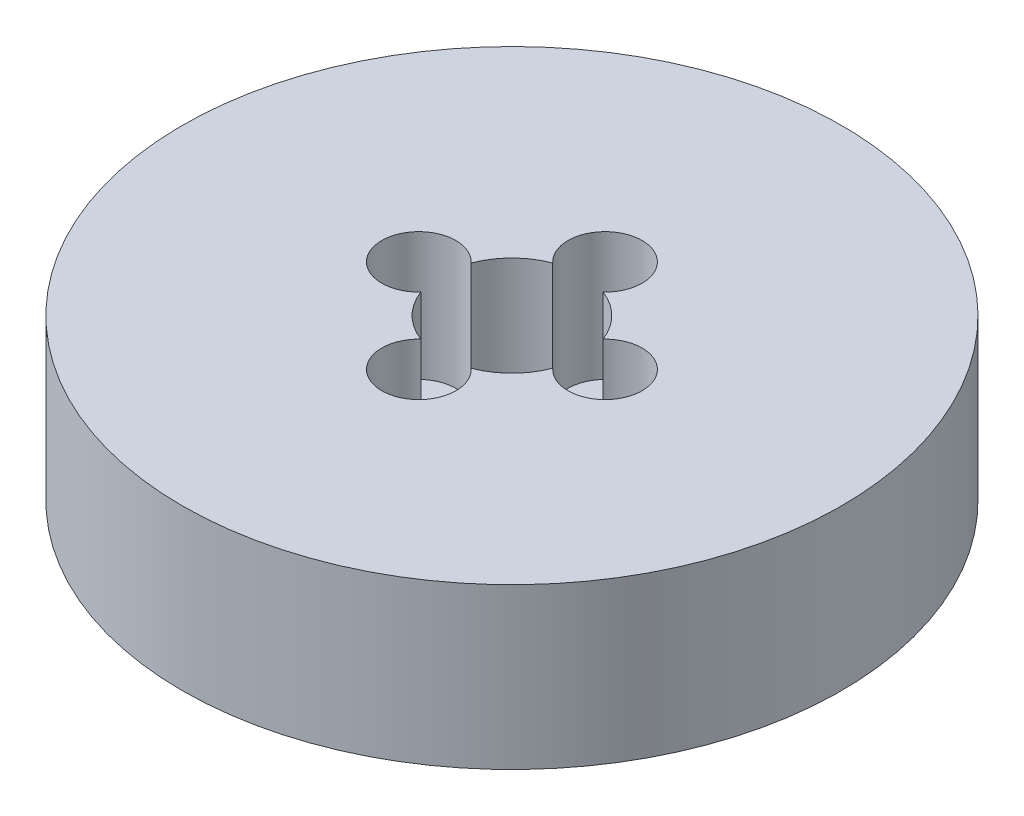
ISO-10303-21;
HEADER;
FILE_DESCRIPTION(('STEP AP214'),'2;1');
FILE_NAME('part.step','',(''),(''),'','','');
FILE_SCHEMA(('AUTOMOTIVE_DESIGN { 1 0 10303 214 1 1 1 1 }'));
ENDSEC;
DATA;
#1=APPLICATION_CONTEXT('core data for automotive mechanical design processes');
#2=APPLICATION_PROTOCOL_DEFINITION('international standard','automotive_design',2000,#1);
#3=PRODUCT_CONTEXT('',#1,'mechanical');
#4=PRODUCT('Part','Part','',(#3));
#5=PRODUCT_RELATED_PRODUCT_CATEGORY('part','',(#4));
#6=PRODUCT_DEFINITION_FORMATION('','',#4);
#7=PRODUCT_DEFINITION_CONTEXT('part definition',#1,'design');
#8=PRODUCT_DEFINITION('design','',#6,#7);
#9=PRODUCT_DEFINITION_SHAPE('','',#8);
#10=(LENGTH_UNIT() NAMED_UNIT(*) SI_UNIT(.MILLI.,.METRE.));
#11=(NAMED_UNIT(*) PLANE_ANGLE_UNIT() SI_UNIT($,.RADIAN.));
#12=(NAMED_UNIT(*) SI_UNIT($,.STERADIAN.) SOLID_ANGLE_UNIT());
#13=UNCERTAINTY_MEASURE_WITH_UNIT(LENGTH_MEASURE(1.E-05),#10,'distance_accuracy_value','');
#14=(GEOMETRIC_REPRESENTATION_CONTEXT(3) GLOBAL_UNCERTAINTY_ASSIGNED_CONTEXT((#13)) GLOBAL_UNIT_ASSIGNED_CONTEXT((#10,
#11,#12)) REPRESENTATION_CONTEXT('',''));
#15=CARTESIAN_POINT('',(0.,0.,0.));
#16=DIRECTION('',(0.,0.,1.));
#17=DIRECTION('',(1.,0.,0.));
#18=AXIS2_PLACEMENT_3D('',#15,#16,#17);
#19=CARTESIAN_POINT('',(0.,17.,0.));
#20=DIRECTION('',(0.,-1.,0.));
#21=DIRECTION('',(0.,0.,-1.));
#22=AXIS2_PLACEMENT_3D('',#19,#20,#21);
#23=CYLINDRICAL_SURFACE('',#22,35.);
#24=CARTESIAN_POINT('',(0.,17.,0.));
#25=DIRECTION('',(0.,1.,0.));
#26=DIRECTION('',(0.,0.,1.));
#27=AXIS2_PLACEMENT_3D('',#24,#25,#26);
#28=CIRCLE('',#27,35.);
#29=CARTESIAN_POINT('',(0.,17.,35.));
#30=VERTEX_POINT('',#29);
#31=EDGE_CURVE('E145',#30,#30,#28,.T.);
#32=ORIENTED_EDGE('',*,*,#31,.F.);
#33=EDGE_LOOP('',(#32));
#34=FACE_BOUND('',#33,.T.);
#35=CARTESIAN_POINT('',(0.,0.,0.));
#36=DIRECTION('',(0.,1.,0.));
#37=DIRECTION('',(0.,0.,1.));
#38=AXIS2_PLACEMENT_3D('',#35,#36,#37);
#39=CIRCLE('',#38,35.);
#40=CARTESIAN_POINT('',(0.,0.,35.));
#41=VERTEX_POINT('',#40);
#42=EDGE_CURVE('E143',#41,#41,#39,.T.);
#43=ORIENTED_EDGE('',*,*,#42,.T.);
#44=EDGE_LOOP('',(#43));
#45=FACE_BOUND('',#44,.T.);
#46=ADVANCED_FACE('F39',(#34,#45),#23,.T.);
#47=CARTESIAN_POINT('',(0.,17.,0.));
#48=DIRECTION('',(0.,1.,0.));
#49=DIRECTION('',(0.,0.,1.));
#50=AXIS2_PLACEMENT_3D('',#47,#48,#49);
#51=PLANE('',#50);
#52=CARTESIAN_POINT('',(0.,17.,9.88932328255691));
#53=DIRECTION('',(0.,1.,0.));
#54=DIRECTION('',(1.,0.,0.));
#55=AXIS2_PLACEMENT_3D('',#52,#53,#54);
#56=CIRCLE('',#55,3.93464013560313);
#57=CARTESIAN_POINT('',(-2.677180030572,17.,7.00590515807247));
#58=VERTEX_POINT('',#57);
#59=CARTESIAN_POINT('',(2.67718003057205,17.,7.00590515807245));
#60=VERTEX_POINT('',#59);
#61=EDGE_CURVE('E152',#58,#60,#56,.T.);
#62=ORIENTED_EDGE('',*,*,#61,.F.);
#63=CARTESIAN_POINT('',(0.,17.,0.));
#64=DIRECTION('',(0.,1.,0.));
#65=DIRECTION('',(0.,0.,1.));
#66=AXIS2_PLACEMENT_3D('',#63,#64,#65);
#67=CIRCLE('',#66,7.5);
#68=CARTESIAN_POINT('',(-7.00590515807246,17.,2.67718003057203));
#69=VERTEX_POINT('',#68);
#70=EDGE_CURVE('E133',#69,#58,#67,.T.);
#71=ORIENTED_EDGE('',*,*,#70,.F.);
#72=CARTESIAN_POINT('',(-9.88932328255691,17.,0.));
#73=DIRECTION('',(0.,1.,0.));
#74=DIRECTION('',(0.,0.,1.));
#75=AXIS2_PLACEMENT_3D('',#72,#73,#74);
#76=CIRCLE('',#75,3.93464013560313);
#77=CARTESIAN_POINT('',(-7.00590515807246,17.,-2.67718003057203));
#78=VERTEX_POINT('',#77);
#79=EDGE_CURVE('E128',#78,#69,#76,.T.);
#80=ORIENTED_EDGE('',*,*,#79,.F.);
#81=CARTESIAN_POINT('',(-2.6771800305721,17.,-7.00590515807244));
#82=VERTEX_POINT('',#81);
#83=EDGE_CURVE('E121',#82,#78,#67,.T.);
#84=ORIENTED_EDGE('',*,*,#83,.F.);
#85=CARTESIAN_POINT('',(-1.03585163084503E-13,17.,-9.88932328255691));
#86=DIRECTION('',(0.,1.,0.));
#87=DIRECTION('',(-1.,0.,0.));
#88=AXIS2_PLACEMENT_3D('',#85,#86,#87);
#89=CIRCLE('',#88,3.93464013560313);
#90=CARTESIAN_POINT('',(2.67718003057196,17.,-7.00590515807249));
#91=VERTEX_POINT('',#90);
#92=EDGE_CURVE('E105',#91,#82,#89,.T.);
#93=ORIENTED_EDGE('',*,*,#92,.F.);
#94=CARTESIAN_POINT('',(7.00590515807246,17.,-2.67718003057203));
#95=VERTEX_POINT('',#94);
#96=EDGE_CURVE('E131',#95,#91,#67,.T.);
#97=ORIENTED_EDGE('',*,*,#96,.F.);
#98=CARTESIAN_POINT('',(9.88932328255691,17.,0.));
#99=DIRECTION('',(0.,1.,0.));
#100=DIRECTION('',(0.,0.,-1.));
#101=AXIS2_PLACEMENT_3D('',#98,#99,#100);
#102=CIRCLE('',#101,3.93464013560313);
#103=CARTESIAN_POINT('',(7.00590515807246,17.,2.67718003057203));
#104=VERTEX_POINT('',#103);
#105=EDGE_CURVE('E154',#104,#95,#102,.T.);
#106=ORIENTED_EDGE('',*,*,#105,.F.);
#107=EDGE_CURVE('E134',#60,#104,#67,.T.);
#108=ORIENTED_EDGE('',*,*,#107,.F.);
#109=EDGE_LOOP('',(#62,#71,#80,#84,#93,#97,#106,#108));
#110=FACE_BOUND('',#109,.T.);
#111=ORIENTED_EDGE('',*,*,#31,.T.);
#112=EDGE_LOOP('',(#111));
#113=FACE_BOUND('',#112,.T.);
#114=ADVANCED_FACE('F130',(#110,#113),#51,.T.);
#115=CARTESIAN_POINT('',(0.,0.,0.));
#116=DIRECTION('',(0.,1.,0.));
#117=DIRECTION('',(0.,0.,1.));
#118=AXIS2_PLACEMENT_3D('',#115,#116,#117);
#119=PLANE('',#118);
#120=CARTESIAN_POINT('',(0.,0.,0.));
#121=DIRECTION('',(0.,1.,0.));
#122=DIRECTION('',(0.,0.,1.));
#123=AXIS2_PLACEMENT_3D('',#120,#121,#122);
#124=CIRCLE('',#123,7.5);
#125=CARTESIAN_POINT('',(0.,0.,7.5));
#126=VERTEX_POINT('',#125);
#127=EDGE_CURVE('E135',#126,#126,#124,.T.);
#128=ORIENTED_EDGE('',*,*,#127,.T.);
#129=EDGE_LOOP('',(#128));
#130=FACE_BOUND('',#129,.T.);
#131=ORIENTED_EDGE('',*,*,#42,.F.);
#132=EDGE_LOOP('',(#131));
#133=FACE_BOUND('',#132,.T.);
#134=ADVANCED_FACE('F195',(#130,#133),#119,.F.);
#135=CARTESIAN_POINT('',(0.,17.,0.));
#136=DIRECTION('',(0.,-1.,0.));
#137=DIRECTION('',(0.,0.,-1.));
#138=AXIS2_PLACEMENT_3D('',#135,#136,#137);
#139=CYLINDRICAL_SURFACE('',#138,7.5);
#140=DIRECTION('',(0.,1.,0.));
#141=VECTOR('',#140,1.);
#142=CARTESIAN_POINT('',(-2.677180030572,10.2009438567264,7.00590515807247));
#143=LINE('',#142,#141);
#144=CARTESIAN_POINT('',(-2.677180030572,3.40188771345281,7.00590515807247));
#145=VERTEX_POINT('',#144);
#146=EDGE_CURVE('E11',#145,#58,#143,.T.);
#147=ORIENTED_EDGE('',*,*,#146,.F.);
#148=CARTESIAN_POINT('',(0.,3.40188771345281,0.));
#149=DIRECTION('',(0.,1.,0.));
#150=DIRECTION('',(0.,0.,1.));
#151=AXIS2_PLACEMENT_3D('',#148,#149,#150);
#152=CIRCLE('',#151,7.5);
#153=CARTESIAN_POINT('',(2.67718003057205,3.40188771345281,7.00590515807245));
#154=VERTEX_POINT('',#153);
#155=EDGE_CURVE('E169',#145,#154,#152,.T.);
#156=ORIENTED_EDGE('',*,*,#155,.T.);
#157=DIRECTION('',(0.,1.,0.));
#158=VECTOR('',#157,1.);
#159=CARTESIAN_POINT('',(2.67718003057205,10.2009438567264,7.00590515807245));
#160=LINE('',#159,#158);
#161=EDGE_CURVE('E46',#60,#154,#160,.F.);
#162=ORIENTED_EDGE('',*,*,#161,.F.);
#163=ORIENTED_EDGE('',*,*,#107,.T.);
#164=DIRECTION('',(0.,1.,0.));
#165=VECTOR('',#164,1.);
#166=CARTESIAN_POINT('',(7.00590515807246,10.2009438567264,2.67718003057203));
#167=LINE('',#166,#165);
#168=CARTESIAN_POINT('',(7.00590515807246,3.40188771345281,2.67718003057203));
#169=VERTEX_POINT('',#168);
#170=EDGE_CURVE('E151',#169,#104,#167,.T.);
#171=ORIENTED_EDGE('',*,*,#170,.F.);
#172=CARTESIAN_POINT('',(0.,3.40188771345281,0.));
#173=DIRECTION('',(0.,1.,0.));
#174=DIRECTION('',(0.,0.,1.));
#175=AXIS2_PLACEMENT_3D('',#172,#173,#174);
#176=CIRCLE('',#175,7.5);
#177=CARTESIAN_POINT('',(7.00590515807246,3.40188771345281,-2.67718003057203));
#178=VERTEX_POINT('',#177);
#179=EDGE_CURVE('E173',#169,#178,#176,.T.);
#180=ORIENTED_EDGE('',*,*,#179,.T.);
#181=DIRECTION('',(0.,1.,0.));
#182=VECTOR('',#181,1.);
#183=CARTESIAN_POINT('',(7.00590515807246,10.2009438567264,-2.67718003057203));
#184=LINE('',#183,#182);
#185=EDGE_CURVE('E168',#95,#178,#184,.F.);
#186=ORIENTED_EDGE('',*,*,#185,.F.);
#187=ORIENTED_EDGE('',*,*,#96,.T.);
#188=DIRECTION('',(0.,1.,0.));
#189=VECTOR('',#188,1.);
#190=CARTESIAN_POINT('',(2.67718003057196,10.2009438567264,-7.00590515807249));
#191=LINE('',#190,#189);
#192=CARTESIAN_POINT('',(2.67718003057196,3.40188771345281,-7.00590515807249));
#193=VERTEX_POINT('',#192);
#194=EDGE_CURVE('E108',#193,#91,#191,.T.);
#195=ORIENTED_EDGE('',*,*,#194,.F.);
#196=CARTESIAN_POINT('',(0.,3.40188771345281,0.));
#197=DIRECTION('',(0.,1.,0.));
#198=DIRECTION('',(0.,0.,1.));
#199=AXIS2_PLACEMENT_3D('',#196,#197,#198);
#200=CIRCLE('',#199,7.5);
#201=CARTESIAN_POINT('',(-2.6771800305721,3.40188771345281,-7.00590515807244));
#202=VERTEX_POINT('',#201);
#203=EDGE_CURVE('E122',#193,#202,#200,.T.);
#204=ORIENTED_EDGE('',*,*,#203,.T.);
#205=DIRECTION('',(0.,1.,0.));
#206=VECTOR('',#205,1.);
#207=CARTESIAN_POINT('',(-2.6771800305721,10.2009438567264,-7.00590515807244));
#208=LINE('',#207,#206);
#209=EDGE_CURVE('E106',#82,#202,#208,.F.);
#210=ORIENTED_EDGE('',*,*,#209,.F.);
#211=ORIENTED_EDGE('',*,*,#83,.T.);
#212=DIRECTION('',(0.,1.,0.));
#213=VECTOR('',#212,1.);
#214=CARTESIAN_POINT('',(-7.00590515807246,10.2009438567264,-2.67718003057203));
#215=LINE('',#214,#213);
#216=CARTESIAN_POINT('',(-7.00590515807246,3.40188771345281,-2.67718003057203));
#217=VERTEX_POINT('',#216);
#218=EDGE_CURVE('E177',#217,#78,#215,.T.);
#219=ORIENTED_EDGE('',*,*,#218,.F.);
#220=CARTESIAN_POINT('',(0.,3.40188771345281,0.));
#221=DIRECTION('',(0.,1.,0.));
#222=DIRECTION('',(0.,0.,1.));
#223=AXIS2_PLACEMENT_3D('',#220,#221,#222);
#224=CIRCLE('',#223,7.5);
#225=CARTESIAN_POINT('',(-7.00590515807246,3.40188771345281,2.67718003057203));
#226=VERTEX_POINT('',#225);
#227=EDGE_CURVE('E185',#217,#226,#224,.T.);
#228=ORIENTED_EDGE('',*,*,#227,.T.);
#229=DIRECTION('',(0.,1.,0.));
#230=VECTOR('',#229,1.);
#231=CARTESIAN_POINT('',(-7.00590515807246,10.2009438567264,2.67718003057203));
#232=LINE('',#231,#230);
#233=EDGE_CURVE('E179',#69,#226,#232,.F.);
#234=ORIENTED_EDGE('',*,*,#233,.F.);
#235=ORIENTED_EDGE('',*,*,#70,.T.);
#236=EDGE_LOOP('',(#147,#156,#162,#163,#171,#180,#186,#187,#195,#204,#210,#211,#219,#228,#234,#235));
#237=FACE_BOUND('',#236,.T.);
#238=ORIENTED_EDGE('',*,*,#127,.F.);
#239=EDGE_LOOP('',(#238));
#240=FACE_BOUND('',#239,.T.);
#241=ADVANCED_FACE('F117',(#237,#240),#139,.F.);
#242=CARTESIAN_POINT('',(-9.88932328255691,3.40188771345281,0.));
#243=DIRECTION('',(0.,1.,0.));
#244=DIRECTION('',(0.,0.,1.));
#245=AXIS2_PLACEMENT_3D('',#242,#243,#244);
#246=CYLINDRICAL_SURFACE('',#245,3.93464013560313);
#247=ORIENTED_EDGE('',*,*,#218,.T.);
#248=ORIENTED_EDGE('',*,*,#79,.T.);
#249=ORIENTED_EDGE('',*,*,#233,.T.);
#250=CARTESIAN_POINT('',(-9.88932328255691,3.40188771345281,0.));
#251=DIRECTION('',(0.,1.,0.));
#252=DIRECTION('',(0.,0.,1.));
#253=AXIS2_PLACEMENT_3D('',#250,#251,#252);
#254=CIRCLE('',#253,3.93464013560313);
#255=EDGE_CURVE('E140',#217,#226,#254,.T.);
#256=ORIENTED_EDGE('',*,*,#255,.F.);
#257=EDGE_LOOP('',(#247,#248,#249,#256));
#258=FACE_BOUND('',#257,.T.);
#259=ADVANCED_FACE('F200',(#258),#246,.F.);
#260=CARTESIAN_POINT('',(-9.88932328255691,3.40188771345281,0.));
#261=DIRECTION('',(0.,1.,0.));
#262=DIRECTION('',(0.,0.,1.));
#263=AXIS2_PLACEMENT_3D('',#260,#261,#262);
#264=PLANE('',#263);
#265=ORIENTED_EDGE('',*,*,#255,.T.);
#266=ORIENTED_EDGE('',*,*,#227,.F.);
#267=EDGE_LOOP('',(#265,#266));
#268=FACE_BOUND('',#267,.T.);
#269=ADVANCED_FACE('F202',(#268),#264,.T.);
#270=CARTESIAN_POINT('',(-1.03585163084503E-13,3.40188771345281,-9.88932328255691));
#271=DIRECTION('',(0.,1.,0.));
#272=DIRECTION('',(0.,0.,1.));
#273=AXIS2_PLACEMENT_3D('',#270,#271,#272);
#274=CYLINDRICAL_SURFACE('',#273,3.93464013560313);
#275=ORIENTED_EDGE('',*,*,#194,.T.);
#276=ORIENTED_EDGE('',*,*,#92,.T.);
#277=ORIENTED_EDGE('',*,*,#209,.T.);
#278=CARTESIAN_POINT('',(-1.03585163084503E-13,3.40188771345281,-9.88932328255691));
#279=DIRECTION('',(0.,1.,0.));
#280=DIRECTION('',(-1.,0.,0.));
#281=AXIS2_PLACEMENT_3D('',#278,#279,#280);
#282=CIRCLE('',#281,3.93464013560313);
#283=EDGE_CURVE('E111',#193,#202,#282,.T.);
#284=ORIENTED_EDGE('',*,*,#283,.F.);
#285=EDGE_LOOP('',(#275,#276,#277,#284));
#286=FACE_BOUND('',#285,.T.);
#287=ADVANCED_FACE('F102',(#286),#274,.F.);
#288=CARTESIAN_POINT('',(-1.03585163084503E-13,3.40188771345281,-9.88932328255691));
#289=DIRECTION('',(0.,1.,0.));
#290=DIRECTION('',(-1.,0.,0.));
#291=AXIS2_PLACEMENT_3D('',#288,#289,#290);
#292=PLANE('',#291);
#293=ORIENTED_EDGE('',*,*,#283,.T.);
#294=ORIENTED_EDGE('',*,*,#203,.F.);
#295=EDGE_LOOP('',(#293,#294));
#296=FACE_BOUND('',#295,.T.);
#297=ADVANCED_FACE('F211',(#296),#292,.T.);
#298=CARTESIAN_POINT('',(9.88932328255691,3.40188771345281,0.));
#299=DIRECTION('',(0.,1.,0.));
#300=DIRECTION('',(0.,0.,1.));
#301=AXIS2_PLACEMENT_3D('',#298,#299,#300);
#302=CYLINDRICAL_SURFACE('',#301,3.93464013560313);
#303=ORIENTED_EDGE('',*,*,#170,.T.);
#304=ORIENTED_EDGE('',*,*,#105,.T.);
#305=ORIENTED_EDGE('',*,*,#185,.T.);
#306=CARTESIAN_POINT('',(9.88932328255691,3.40188771345281,0.));
#307=DIRECTION('',(0.,1.,0.));
#308=DIRECTION('',(0.,0.,-1.));
#309=AXIS2_PLACEMENT_3D('',#306,#307,#308);
#310=CIRCLE('',#309,3.93464013560313);
#311=EDGE_CURVE('E56',#169,#178,#310,.T.);
#312=ORIENTED_EDGE('',*,*,#311,.F.);
#313=EDGE_LOOP('',(#303,#304,#305,#312));
#314=FACE_BOUND('',#313,.T.);
#315=ADVANCED_FACE('F212',(#314),#302,.F.);
#316=CARTESIAN_POINT('',(9.88932328255691,3.40188771345281,0.));
#317=DIRECTION('',(0.,1.,0.));
#318=DIRECTION('',(0.,0.,-1.));
#319=AXIS2_PLACEMENT_3D('',#316,#317,#318);
#320=PLANE('',#319);
#321=ORIENTED_EDGE('',*,*,#311,.T.);
#322=ORIENTED_EDGE('',*,*,#179,.F.);
#323=EDGE_LOOP('',(#321,#322));
#324=FACE_BOUND('',#323,.T.);
#325=ADVANCED_FACE('F217',(#324),#320,.T.);
#326=CARTESIAN_POINT('',(0.,3.40188771345281,9.88932328255691));
#327=DIRECTION('',(0.,1.,0.));
#328=DIRECTION('',(0.,0.,1.));
#329=AXIS2_PLACEMENT_3D('',#326,#327,#328);
#330=CYLINDRICAL_SURFACE('',#329,3.93464013560313);
#331=ORIENTED_EDGE('',*,*,#146,.T.);
#332=ORIENTED_EDGE('',*,*,#61,.T.);
#333=ORIENTED_EDGE('',*,*,#161,.T.);
#334=CARTESIAN_POINT('',(0.,3.40188771345281,9.88932328255691));
#335=DIRECTION('',(0.,1.,0.));
#336=DIRECTION('',(1.,0.,0.));
#337=AXIS2_PLACEMENT_3D('',#334,#335,#336);
#338=CIRCLE('',#337,3.93464013560313);
#339=EDGE_CURVE('E55',#145,#154,#338,.T.);
#340=ORIENTED_EDGE('',*,*,#339,.F.);
#341=EDGE_LOOP('',(#331,#332,#333,#340));
#342=FACE_BOUND('',#341,.T.);
#343=ADVANCED_FACE('F170',(#342),#330,.F.);
#344=CARTESIAN_POINT('',(0.,3.40188771345281,9.88932328255691));
#345=DIRECTION('',(0.,1.,0.));
#346=DIRECTION('',(1.,0.,0.));
#347=AXIS2_PLACEMENT_3D('',#344,#345,#346);
#348=PLANE('',#347);
#349=ORIENTED_EDGE('',*,*,#339,.T.);
#350=ORIENTED_EDGE('',*,*,#155,.F.);
#351=EDGE_LOOP('',(#349,#350));
#352=FACE_BOUND('',#351,.T.);
#353=ADVANCED_FACE('F224',(#352),#348,.T.);
#354=CLOSED_SHELL('',(#46,#114,#134,#241,#259,#269,#287,#297,#315,#325,#343,#353));
#355=MANIFOLD_SOLID_BREP('B2',#354);
#356=ADVANCED_BREP_SHAPE_REPRESENTATION('',(#18,#355),#14);
#357=SHAPE_DEFINITION_REPRESENTATION(#9,#356);
ENDSEC;
END-ISO-10303-21;
